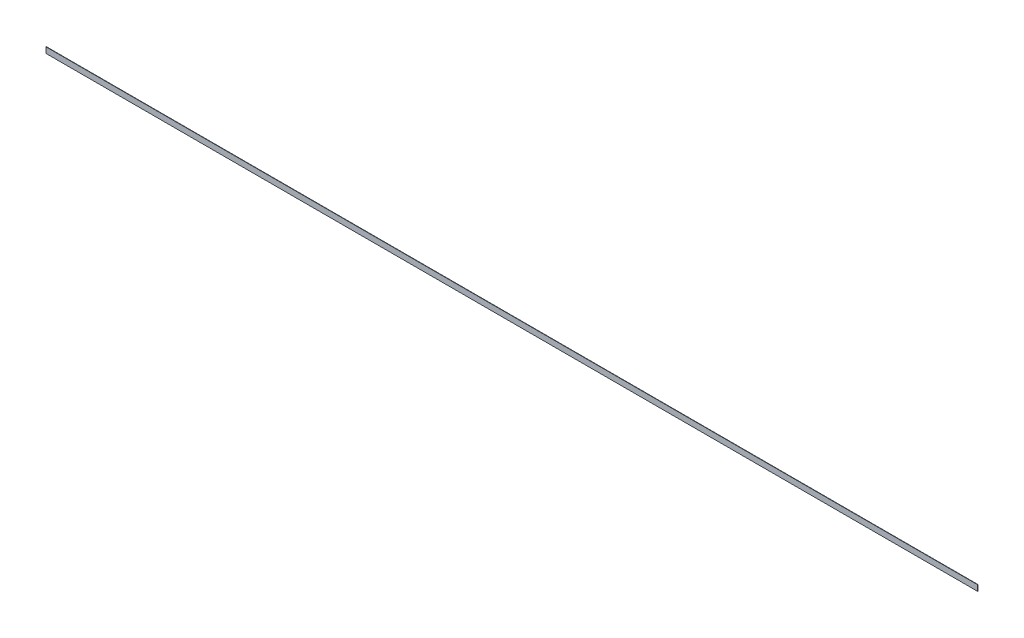
ISO-10303-21;
HEADER;
FILE_DESCRIPTION(('STEP AP214'),'2;1');
FILE_NAME('part.step','',(''),(''),'','','');
FILE_SCHEMA(('AUTOMOTIVE_DESIGN { 1 0 10303 214 1 1 1 1 }'));
ENDSEC;
DATA;
#1=APPLICATION_CONTEXT('core data for automotive mechanical design processes');
#2=APPLICATION_PROTOCOL_DEFINITION('international standard','automotive_design',2000,#1);
#3=PRODUCT_CONTEXT('',#1,'mechanical');
#4=PRODUCT('Part','Part','',(#3));
#5=PRODUCT_RELATED_PRODUCT_CATEGORY('part','',(#4));
#6=PRODUCT_DEFINITION_FORMATION('','',#4);
#7=PRODUCT_DEFINITION_CONTEXT('part definition',#1,'design');
#8=PRODUCT_DEFINITION('design','',#6,#7);
#9=PRODUCT_DEFINITION_SHAPE('','',#8);
#10=(LENGTH_UNIT() NAMED_UNIT(*) SI_UNIT(.MILLI.,.METRE.));
#11=(NAMED_UNIT(*) PLANE_ANGLE_UNIT() SI_UNIT($,.RADIAN.));
#12=(NAMED_UNIT(*) SI_UNIT($,.STERADIAN.) SOLID_ANGLE_UNIT());
#13=UNCERTAINTY_MEASURE_WITH_UNIT(LENGTH_MEASURE(1.E-05),#10,'distance_accuracy_value','');
#14=(GEOMETRIC_REPRESENTATION_CONTEXT(3) GLOBAL_UNCERTAINTY_ASSIGNED_CONTEXT((#13)) GLOBAL_UNIT_ASSIGNED_CONTEXT((#10,
#11,#12)) REPRESENTATION_CONTEXT('',''));
#15=CARTESIAN_POINT('',(0.,0.,0.));
#16=DIRECTION('',(0.,0.,1.));
#17=DIRECTION('',(1.,0.,0.));
#18=AXIS2_PLACEMENT_3D('',#15,#16,#17);
#19=CARTESIAN_POINT('',(-4114.8,-25.4,-3.175));
#20=DIRECTION('',(0.,0.,-1.));
#21=DIRECTION('',(-1.,0.,0.));
#22=AXIS2_PLACEMENT_3D('',#19,#20,#21);
#23=PLANE('',#22);
#24=DIRECTION('',(1.,0.,0.));
#25=VECTOR('',#24,1.);
#26=CARTESIAN_POINT('',(-4114.8,-25.4,-3.175));
#27=LINE('',#26,#25);
#28=CARTESIAN_POINT('',(-4114.8,-25.4,-3.175));
#29=VERTEX_POINT('',#28);
#30=CARTESIAN_POINT('',(4114.8,-25.4,-3.175));
#31=VERTEX_POINT('',#30);
#32=EDGE_CURVE('E20',#29,#31,#27,.T.);
#33=ORIENTED_EDGE('',*,*,#32,.F.);
#34=DIRECTION('',(0.,1.,0.));
#35=VECTOR('',#34,1.);
#36=CARTESIAN_POINT('',(-4114.8,0.,-3.175));
#37=LINE('',#36,#35);
#38=CARTESIAN_POINT('',(-4114.8,25.4,-3.175));
#39=VERTEX_POINT('',#38);
#40=EDGE_CURVE('E80',#29,#39,#37,.T.);
#41=ORIENTED_EDGE('',*,*,#40,.T.);
#42=DIRECTION('',(1.,0.,0.));
#43=VECTOR('',#42,1.);
#44=CARTESIAN_POINT('',(-4114.8,25.4,-3.175));
#45=LINE('',#44,#43);
#46=CARTESIAN_POINT('',(4114.8,25.4,-3.175));
#47=VERTEX_POINT('',#46);
#48=EDGE_CURVE('E68',#47,#39,#45,.F.);
#49=ORIENTED_EDGE('',*,*,#48,.F.);
#50=DIRECTION('',(0.,1.,0.));
#51=VECTOR('',#50,1.);
#52=CARTESIAN_POINT('',(4114.8,0.,-3.175));
#53=LINE('',#52,#51);
#54=EDGE_CURVE('E56',#31,#47,#53,.T.);
#55=ORIENTED_EDGE('',*,*,#54,.F.);
#56=EDGE_LOOP('',(#33,#41,#49,#55));
#57=FACE_BOUND('',#56,.T.);
#58=ADVANCED_FACE('F17',(#57),#23,.T.);
#59=CARTESIAN_POINT('',(-4114.8,-25.4,0.));
#60=DIRECTION('',(0.,-1.,0.));
#61=DIRECTION('',(0.,0.,-1.));
#62=AXIS2_PLACEMENT_3D('',#59,#60,#61);
#63=PLANE('',#62);
#64=DIRECTION('',(1.,0.,0.));
#65=VECTOR('',#64,1.);
#66=CARTESIAN_POINT('',(-4114.8,-25.4,0.));
#67=LINE('',#66,#65);
#68=CARTESIAN_POINT('',(-4114.8,-25.4,0.));
#69=VERTEX_POINT('',#68);
#70=CARTESIAN_POINT('',(4114.8,-25.4,0.));
#71=VERTEX_POINT('',#70);
#72=EDGE_CURVE('E83',#69,#71,#67,.T.);
#73=ORIENTED_EDGE('',*,*,#72,.F.);
#74=DIRECTION('',(0.,0.,-1.));
#75=VECTOR('',#74,1.);
#76=CARTESIAN_POINT('',(-4114.8,-25.4,0.));
#77=LINE('',#76,#75);
#78=EDGE_CURVE('E65',#69,#29,#77,.T.);
#79=ORIENTED_EDGE('',*,*,#78,.T.);
#80=ORIENTED_EDGE('',*,*,#32,.T.);
#81=DIRECTION('',(0.,0.,-1.));
#82=VECTOR('',#81,1.);
#83=CARTESIAN_POINT('',(4114.8,-25.4,0.));
#84=LINE('',#83,#82);
#85=EDGE_CURVE('E62',#71,#31,#84,.T.);
#86=ORIENTED_EDGE('',*,*,#85,.F.);
#87=EDGE_LOOP('',(#73,#79,#80,#86));
#88=FACE_BOUND('',#87,.T.);
#89=ADVANCED_FACE('F61',(#88),#63,.T.);
#90=CARTESIAN_POINT('',(4114.8,0.,0.));
#91=DIRECTION('',(1.,0.,0.));
#92=DIRECTION('',(0.,0.,-1.));
#93=AXIS2_PLACEMENT_3D('',#90,#91,#92);
#94=PLANE('',#93);
#95=DIRECTION('',(0.,0.,1.));
#96=VECTOR('',#95,1.);
#97=CARTESIAN_POINT('',(4114.8,25.4,-3.175));
#98=LINE('',#97,#96);
#99=CARTESIAN_POINT('',(4114.8,25.4,0.));
#100=VERTEX_POINT('',#99);
#101=EDGE_CURVE('E70',#100,#47,#98,.F.);
#102=ORIENTED_EDGE('',*,*,#101,.F.);
#103=DIRECTION('',(0.,1.,0.));
#104=VECTOR('',#103,1.);
#105=CARTESIAN_POINT('',(4114.8,25.4,0.));
#106=LINE('',#105,#104);
#107=EDGE_CURVE('E74',#71,#100,#106,.T.);
#108=ORIENTED_EDGE('',*,*,#107,.F.);
#109=ORIENTED_EDGE('',*,*,#85,.T.);
#110=ORIENTED_EDGE('',*,*,#54,.T.);
#111=EDGE_LOOP('',(#102,#108,#109,#110));
#112=FACE_BOUND('',#111,.T.);
#113=ADVANCED_FACE('F72',(#112),#94,.T.);
#114=CARTESIAN_POINT('',(-4114.8,25.4,-3.175));
#115=DIRECTION('',(0.,1.,0.));
#116=DIRECTION('',(0.,0.,1.));
#117=AXIS2_PLACEMENT_3D('',#114,#115,#116);
#118=PLANE('',#117);
#119=ORIENTED_EDGE('',*,*,#48,.T.);
#120=DIRECTION('',(0.,0.,-1.));
#121=VECTOR('',#120,1.);
#122=CARTESIAN_POINT('',(-4114.8,25.4,0.));
#123=LINE('',#122,#121);
#124=CARTESIAN_POINT('',(-4114.8,25.4,0.));
#125=VERTEX_POINT('',#124);
#126=EDGE_CURVE('E35',#39,#125,#123,.F.);
#127=ORIENTED_EDGE('',*,*,#126,.T.);
#128=DIRECTION('',(1.,0.,0.));
#129=VECTOR('',#128,1.);
#130=CARTESIAN_POINT('',(-4114.8,25.4,0.));
#131=LINE('',#130,#129);
#132=EDGE_CURVE('E26',#100,#125,#131,.F.);
#133=ORIENTED_EDGE('',*,*,#132,.F.);
#134=ORIENTED_EDGE('',*,*,#101,.T.);
#135=EDGE_LOOP('',(#119,#127,#133,#134));
#136=FACE_BOUND('',#135,.T.);
#137=ADVANCED_FACE('F89',(#136),#118,.T.);
#138=CARTESIAN_POINT('',(-4114.8,0.,0.));
#139=DIRECTION('',(1.,0.,0.));
#140=DIRECTION('',(0.,0.,-1.));
#141=AXIS2_PLACEMENT_3D('',#138,#139,#140);
#142=PLANE('',#141);
#143=ORIENTED_EDGE('',*,*,#40,.F.);
#144=ORIENTED_EDGE('',*,*,#78,.F.);
#145=DIRECTION('',(0.,1.,0.));
#146=VECTOR('',#145,1.);
#147=CARTESIAN_POINT('',(-4114.8,25.4,0.));
#148=LINE('',#147,#146);
#149=EDGE_CURVE('E11',#125,#69,#148,.F.);
#150=ORIENTED_EDGE('',*,*,#149,.F.);
#151=ORIENTED_EDGE('',*,*,#126,.F.);
#152=EDGE_LOOP('',(#143,#144,#150,#151));
#153=FACE_BOUND('',#152,.T.);
#154=ADVANCED_FACE('F91',(#153),#142,.F.);
#155=CARTESIAN_POINT('',(-4114.8,25.4,0.));
#156=DIRECTION('',(0.,0.,1.));
#157=DIRECTION('',(1.,0.,0.));
#158=AXIS2_PLACEMENT_3D('',#155,#156,#157);
#159=PLANE('',#158);
#160=ORIENTED_EDGE('',*,*,#132,.T.);
#161=ORIENTED_EDGE('',*,*,#149,.T.);
#162=ORIENTED_EDGE('',*,*,#72,.T.);
#163=ORIENTED_EDGE('',*,*,#107,.T.);
#164=EDGE_LOOP('',(#160,#161,#162,#163));
#165=FACE_BOUND('',#164,.T.);
#166=ADVANCED_FACE('F88',(#165),#159,.T.);
#167=CLOSED_SHELL('',(#58,#89,#113,#137,#154,#166));
#168=MANIFOLD_SOLID_BREP('B1',#167);
#169=ADVANCED_BREP_SHAPE_REPRESENTATION('',(#18,#168),#14);
#170=SHAPE_DEFINITION_REPRESENTATION(#9,#169);
ENDSEC;
END-ISO-10303-21;
